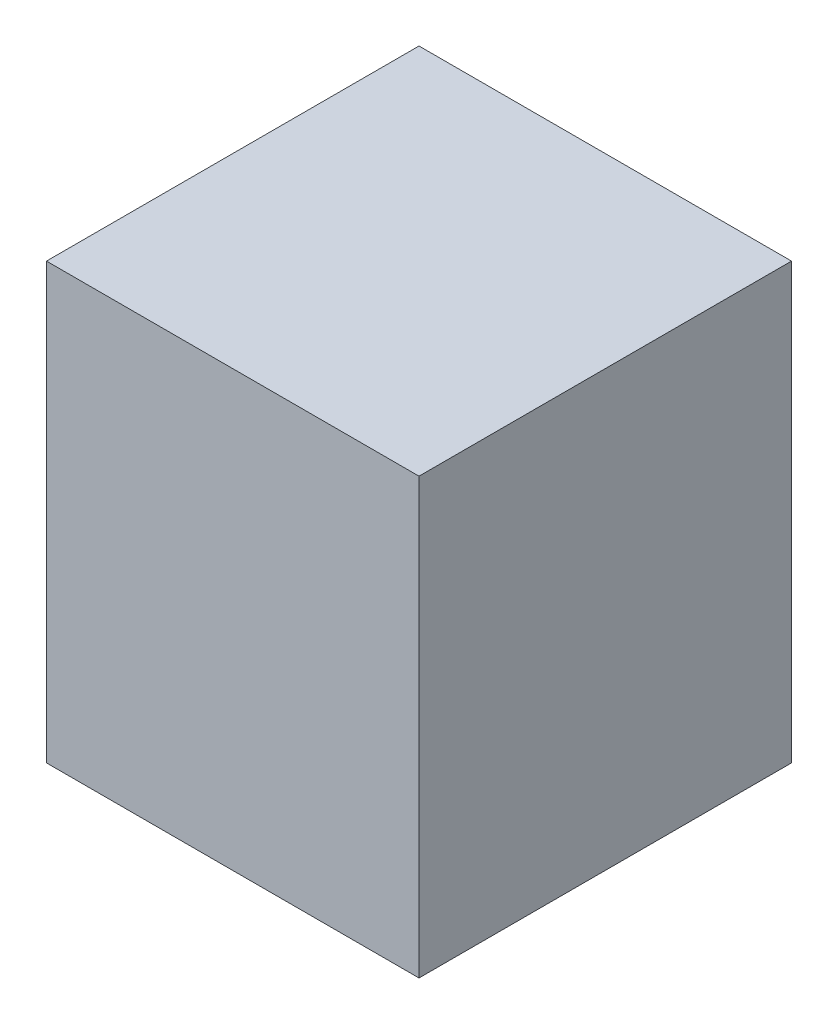
ISO-10303-21;
HEADER;
FILE_DESCRIPTION(('STEP AP214'),'2;1');
FILE_NAME('part.step','',(''),(''),'','','');
FILE_SCHEMA(('AUTOMOTIVE_DESIGN { 1 0 10303 214 1 1 1 1 }'));
ENDSEC;
DATA;
#1=APPLICATION_CONTEXT('core data for automotive mechanical design processes');
#2=APPLICATION_PROTOCOL_DEFINITION('international standard','automotive_design',2000,#1);
#3=PRODUCT_CONTEXT('',#1,'mechanical');
#4=PRODUCT('Part','Part','',(#3));
#5=PRODUCT_RELATED_PRODUCT_CATEGORY('part','',(#4));
#6=PRODUCT_DEFINITION_FORMATION('','',#4);
#7=PRODUCT_DEFINITION_CONTEXT('part definition',#1,'design');
#8=PRODUCT_DEFINITION('design','',#6,#7);
#9=PRODUCT_DEFINITION_SHAPE('','',#8);
#10=(LENGTH_UNIT() NAMED_UNIT(*) SI_UNIT(.MILLI.,.METRE.));
#11=(NAMED_UNIT(*) PLANE_ANGLE_UNIT() SI_UNIT($,.RADIAN.));
#12=(NAMED_UNIT(*) SI_UNIT($,.STERADIAN.) SOLID_ANGLE_UNIT());
#13=UNCERTAINTY_MEASURE_WITH_UNIT(LENGTH_MEASURE(1.E-05),#10,'distance_accuracy_value','');
#14=(GEOMETRIC_REPRESENTATION_CONTEXT(3) GLOBAL_UNCERTAINTY_ASSIGNED_CONTEXT((#13)) GLOBAL_UNIT_ASSIGNED_CONTEXT((#10,
#11,#12)) REPRESENTATION_CONTEXT('',''));
#15=CARTESIAN_POINT('',(0.,0.,0.));
#16=DIRECTION('',(0.,0.,1.));
#17=DIRECTION('',(1.,0.,0.));
#18=AXIS2_PLACEMENT_3D('',#15,#16,#17);
#19=CARTESIAN_POINT('',(-38.1,-44.45,38.1));
#20=DIRECTION('',(1.,0.,0.));
#21=DIRECTION('',(0.,0.,-1.));
#22=AXIS2_PLACEMENT_3D('',#19,#20,#21);
#23=PLANE('',#22);
#24=DIRECTION('',(0.,-1.,0.));
#25=VECTOR('',#24,1.);
#26=CARTESIAN_POINT('',(-38.1,-44.45,-38.1));
#27=LINE('',#26,#25);
#28=CARTESIAN_POINT('',(-38.1,44.45,-38.1));
#29=VERTEX_POINT('',#28);
#30=CARTESIAN_POINT('',(-38.1,-44.45,-38.1));
#31=VERTEX_POINT('',#30);
#32=EDGE_CURVE('E106',#29,#31,#27,.T.);
#33=ORIENTED_EDGE('',*,*,#32,.T.);
#34=DIRECTION('',(0.,0.,-1.));
#35=VECTOR('',#34,1.);
#36=CARTESIAN_POINT('',(-38.1,-44.45,38.1));
#37=LINE('',#36,#35);
#38=CARTESIAN_POINT('',(-38.1,-44.45,38.1));
#39=VERTEX_POINT('',#38);
#40=EDGE_CURVE('E11',#39,#31,#37,.T.);
#41=ORIENTED_EDGE('',*,*,#40,.F.);
#42=DIRECTION('',(0.,-1.,0.));
#43=VECTOR('',#42,1.);
#44=CARTESIAN_POINT('',(-38.1,-44.45,38.1));
#45=LINE('',#44,#43);
#46=CARTESIAN_POINT('',(-38.1,44.45,38.1));
#47=VERTEX_POINT('',#46);
#48=EDGE_CURVE('E94',#47,#39,#45,.T.);
#49=ORIENTED_EDGE('',*,*,#48,.F.);
#50=DIRECTION('',(0.,0.,-1.));
#51=VECTOR('',#50,1.);
#52=CARTESIAN_POINT('',(-38.1,44.45,38.1));
#53=LINE('',#52,#51);
#54=EDGE_CURVE('E102',#47,#29,#53,.T.);
#55=ORIENTED_EDGE('',*,*,#54,.T.);
#56=EDGE_LOOP('',(#33,#41,#49,#55));
#57=FACE_BOUND('',#56,.T.);
#58=ADVANCED_FACE('F43',(#57),#23,.F.);
#59=CARTESIAN_POINT('',(38.1,-44.45,38.1));
#60=DIRECTION('',(0.,1.,0.));
#61=DIRECTION('',(-1.,0.,0.));
#62=AXIS2_PLACEMENT_3D('',#59,#60,#61);
#63=PLANE('',#62);
#64=DIRECTION('',(1.,0.,0.));
#65=VECTOR('',#64,1.);
#66=CARTESIAN_POINT('',(38.1,-44.45,-38.1));
#67=LINE('',#66,#65);
#68=CARTESIAN_POINT('',(38.1,-44.45,-38.1));
#69=VERTEX_POINT('',#68);
#70=EDGE_CURVE('E98',#31,#69,#67,.T.);
#71=ORIENTED_EDGE('',*,*,#70,.T.);
#72=DIRECTION('',(0.,0.,-1.));
#73=VECTOR('',#72,1.);
#74=CARTESIAN_POINT('',(38.1,-44.45,38.1));
#75=LINE('',#74,#73);
#76=CARTESIAN_POINT('',(38.1,-44.45,38.1));
#77=VERTEX_POINT('',#76);
#78=EDGE_CURVE('E51',#77,#69,#75,.T.);
#79=ORIENTED_EDGE('',*,*,#78,.F.);
#80=DIRECTION('',(1.,0.,0.));
#81=VECTOR('',#80,1.);
#82=CARTESIAN_POINT('',(38.1,-44.45,38.1));
#83=LINE('',#82,#81);
#84=EDGE_CURVE('E89',#39,#77,#83,.T.);
#85=ORIENTED_EDGE('',*,*,#84,.F.);
#86=ORIENTED_EDGE('',*,*,#40,.T.);
#87=EDGE_LOOP('',(#71,#79,#85,#86));
#88=FACE_BOUND('',#87,.T.);
#89=ADVANCED_FACE('F97',(#88),#63,.F.);
#90=CARTESIAN_POINT('',(38.1,-44.45,38.1));
#91=DIRECTION('',(-1.,0.,0.));
#92=DIRECTION('',(0.,0.,1.));
#93=AXIS2_PLACEMENT_3D('',#90,#91,#92);
#94=PLANE('',#93);
#95=DIRECTION('',(0.,1.,0.));
#96=VECTOR('',#95,1.);
#97=CARTESIAN_POINT('',(38.1,-44.45,-38.1));
#98=LINE('',#97,#96);
#99=CARTESIAN_POINT('',(38.1,44.45,-38.1));
#100=VERTEX_POINT('',#99);
#101=EDGE_CURVE('E76',#69,#100,#98,.T.);
#102=ORIENTED_EDGE('',*,*,#101,.T.);
#103=DIRECTION('',(0.,0.,-1.));
#104=VECTOR('',#103,1.);
#105=CARTESIAN_POINT('',(38.1,44.45,38.1));
#106=LINE('',#105,#104);
#107=CARTESIAN_POINT('',(38.1,44.45,38.1));
#108=VERTEX_POINT('',#107);
#109=EDGE_CURVE('E99',#108,#100,#106,.T.);
#110=ORIENTED_EDGE('',*,*,#109,.F.);
#111=DIRECTION('',(0.,1.,0.));
#112=VECTOR('',#111,1.);
#113=CARTESIAN_POINT('',(38.1,-44.45,38.1));
#114=LINE('',#113,#112);
#115=EDGE_CURVE('E92',#77,#108,#114,.T.);
#116=ORIENTED_EDGE('',*,*,#115,.F.);
#117=ORIENTED_EDGE('',*,*,#78,.T.);
#118=EDGE_LOOP('',(#102,#110,#116,#117));
#119=FACE_BOUND('',#118,.T.);
#120=ADVANCED_FACE('F100',(#119),#94,.F.);
#121=CARTESIAN_POINT('',(38.1,44.45,38.1));
#122=DIRECTION('',(0.,-1.,0.));
#123=DIRECTION('',(0.,0.,-1.));
#124=AXIS2_PLACEMENT_3D('',#121,#122,#123);
#125=PLANE('',#124);
#126=DIRECTION('',(-1.,0.,0.));
#127=VECTOR('',#126,1.);
#128=CARTESIAN_POINT('',(38.1,44.45,-38.1));
#129=LINE('',#128,#127);
#130=EDGE_CURVE('E82',#100,#29,#129,.T.);
#131=ORIENTED_EDGE('',*,*,#130,.T.);
#132=ORIENTED_EDGE('',*,*,#54,.F.);
#133=DIRECTION('',(-1.,0.,0.));
#134=VECTOR('',#133,1.);
#135=CARTESIAN_POINT('',(38.1,44.45,38.1));
#136=LINE('',#135,#134);
#137=EDGE_CURVE('E59',#108,#47,#136,.T.);
#138=ORIENTED_EDGE('',*,*,#137,.F.);
#139=ORIENTED_EDGE('',*,*,#109,.T.);
#140=EDGE_LOOP('',(#131,#132,#138,#139));
#141=FACE_BOUND('',#140,.T.);
#142=ADVANCED_FACE('F113',(#141),#125,.F.);
#143=CARTESIAN_POINT('',(0.,0.,38.1));
#144=DIRECTION('',(0.,0.,1.));
#145=DIRECTION('',(1.,0.,0.));
#146=AXIS2_PLACEMENT_3D('',#143,#144,#145);
#147=PLANE('',#146);
#148=ORIENTED_EDGE('',*,*,#48,.T.);
#149=ORIENTED_EDGE('',*,*,#84,.T.);
#150=ORIENTED_EDGE('',*,*,#115,.T.);
#151=ORIENTED_EDGE('',*,*,#137,.T.);
#152=EDGE_LOOP('',(#148,#149,#150,#151));
#153=FACE_BOUND('',#152,.T.);
#154=ADVANCED_FACE('F90',(#153),#147,.T.);
#155=CARTESIAN_POINT('',(0.,0.,-38.1));
#156=DIRECTION('',(0.,0.,1.));
#157=DIRECTION('',(1.,0.,0.));
#158=AXIS2_PLACEMENT_3D('',#155,#156,#157);
#159=PLANE('',#158);
#160=ORIENTED_EDGE('',*,*,#32,.F.);
#161=ORIENTED_EDGE('',*,*,#130,.F.);
#162=ORIENTED_EDGE('',*,*,#101,.F.);
#163=ORIENTED_EDGE('',*,*,#70,.F.);
#164=EDGE_LOOP('',(#160,#161,#162,#163));
#165=FACE_BOUND('',#164,.T.);
#166=ADVANCED_FACE('F116',(#165),#159,.F.);
#167=CLOSED_SHELL('',(#58,#89,#120,#142,#154,#166));
#168=MANIFOLD_SOLID_BREP('B2',#167);
#169=ADVANCED_BREP_SHAPE_REPRESENTATION('',(#18,#168),#14);
#170=SHAPE_DEFINITION_REPRESENTATION(#9,#169);
ENDSEC;
END-ISO-10303-21;
